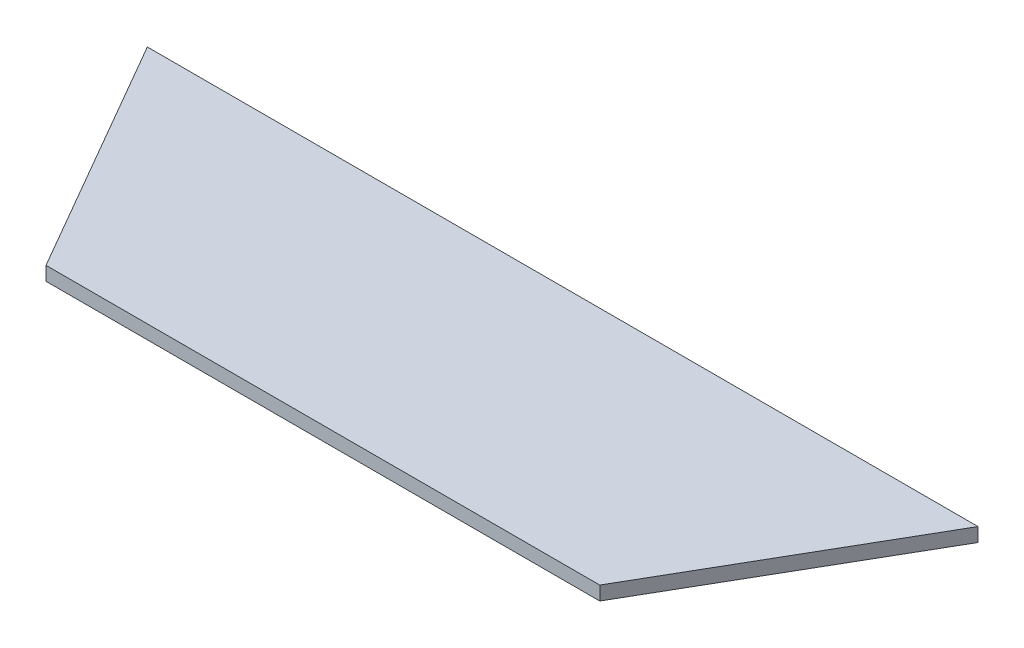
ISO-10303-21;
HEADER;
FILE_DESCRIPTION(('STEP AP214'),'2;1');
FILE_NAME('part.step','',(''),(''),'','','');
FILE_SCHEMA(('AUTOMOTIVE_DESIGN { 1 0 10303 214 1 1 1 1 }'));
ENDSEC;
DATA;
#1=APPLICATION_CONTEXT('core data for automotive mechanical design processes');
#2=APPLICATION_PROTOCOL_DEFINITION('international standard','automotive_design',2000,#1);
#3=PRODUCT_CONTEXT('',#1,'mechanical');
#4=PRODUCT('Part','Part','',(#3));
#5=PRODUCT_RELATED_PRODUCT_CATEGORY('part','',(#4));
#6=PRODUCT_DEFINITION_FORMATION('','',#4);
#7=PRODUCT_DEFINITION_CONTEXT('part definition',#1,'design');
#8=PRODUCT_DEFINITION('design','',#6,#7);
#9=PRODUCT_DEFINITION_SHAPE('','',#8);
#10=(LENGTH_UNIT() NAMED_UNIT(*) SI_UNIT(.MILLI.,.METRE.));
#11=(NAMED_UNIT(*) PLANE_ANGLE_UNIT() SI_UNIT($,.RADIAN.));
#12=(NAMED_UNIT(*) SI_UNIT($,.STERADIAN.) SOLID_ANGLE_UNIT());
#13=UNCERTAINTY_MEASURE_WITH_UNIT(LENGTH_MEASURE(1.E-05),#10,'distance_accuracy_value','');
#14=(GEOMETRIC_REPRESENTATION_CONTEXT(3) GLOBAL_UNCERTAINTY_ASSIGNED_CONTEXT((#13)) GLOBAL_UNIT_ASSIGNED_CONTEXT((#10,
#11,#12)) REPRESENTATION_CONTEXT('',''));
#15=CARTESIAN_POINT('',(0.,0.,0.));
#16=DIRECTION('',(0.,0.,1.));
#17=DIRECTION('',(1.,0.,0.));
#18=AXIS2_PLACEMENT_3D('',#15,#16,#17);
#19=CARTESIAN_POINT('',(-150.,5.,86.6025403784441));
#20=DIRECTION('',(0.,0.,1.));
#21=DIRECTION('',(1.,0.,0.));
#22=AXIS2_PLACEMENT_3D('',#19,#20,#21);
#23=PLANE('',#22);
#24=DIRECTION('',(-1.,0.,0.));
#25=VECTOR('',#24,1.);
#26=CARTESIAN_POINT('',(-150.,0.,86.6025403784441));
#27=LINE('',#26,#25);
#28=CARTESIAN_POINT('',(150.,0.,86.6025403784441));
#29=VERTEX_POINT('',#28);
#30=CARTESIAN_POINT('',(-150.,0.,86.6025403784441));
#31=VERTEX_POINT('',#30);
#32=EDGE_CURVE('E100',#29,#31,#27,.T.);
#33=ORIENTED_EDGE('',*,*,#32,.T.);
#34=DIRECTION('',(0.,-1.,0.));
#35=VECTOR('',#34,1.);
#36=CARTESIAN_POINT('',(-150.,5.,86.6025403784441));
#37=LINE('',#36,#35);
#38=CARTESIAN_POINT('',(-150.,5.,86.6025403784441));
#39=VERTEX_POINT('',#38);
#40=EDGE_CURVE('E11',#39,#31,#37,.T.);
#41=ORIENTED_EDGE('',*,*,#40,.F.);
#42=DIRECTION('',(-1.,0.,0.));
#43=VECTOR('',#42,1.);
#44=CARTESIAN_POINT('',(-150.,5.,86.6025403784441));
#45=LINE('',#44,#43);
#46=CARTESIAN_POINT('',(150.,5.,86.6025403784441));
#47=VERTEX_POINT('',#46);
#48=EDGE_CURVE('E88',#47,#39,#45,.T.);
#49=ORIENTED_EDGE('',*,*,#48,.F.);
#50=DIRECTION('',(0.,-1.,0.));
#51=VECTOR('',#50,1.);
#52=CARTESIAN_POINT('',(150.,5.,86.6025403784441));
#53=LINE('',#52,#51);
#54=EDGE_CURVE('E96',#47,#29,#53,.T.);
#55=ORIENTED_EDGE('',*,*,#54,.T.);
#56=EDGE_LOOP('',(#33,#41,#49,#55));
#57=FACE_BOUND('',#56,.T.);
#58=ADVANCED_FACE('F37',(#57),#23,.F.);
#59=CARTESIAN_POINT('',(-150.,5.,86.6025403784441));
#60=DIRECTION('',(0.86602540378443,0.,-0.500000000000014));
#61=DIRECTION('',(-0.500000000000014,0.,-0.86602540378443));
#62=AXIS2_PLACEMENT_3D('',#59,#60,#61);
#63=PLANE('',#62);
#64=DIRECTION('',(0.500000000000014,0.,0.86602540378443));
#65=VECTOR('',#64,1.);
#66=CARTESIAN_POINT('',(-150.,0.,86.6025403784441));
#67=LINE('',#66,#65);
#68=CARTESIAN_POINT('',(-99.9999999999982,0.,173.205080756888));
#69=VERTEX_POINT('',#68);
#70=EDGE_CURVE('E92',#31,#69,#67,.T.);
#71=ORIENTED_EDGE('',*,*,#70,.T.);
#72=DIRECTION('',(0.,-1.,0.));
#73=VECTOR('',#72,1.);
#74=CARTESIAN_POINT('',(-99.9999999999982,5.,173.205080756888));
#75=LINE('',#74,#73);
#76=CARTESIAN_POINT('',(-99.9999999999982,5.,173.205080756888));
#77=VERTEX_POINT('',#76);
#78=EDGE_CURVE('E45',#77,#69,#75,.T.);
#79=ORIENTED_EDGE('',*,*,#78,.F.);
#80=DIRECTION('',(0.500000000000014,0.,0.86602540378443));
#81=VECTOR('',#80,1.);
#82=CARTESIAN_POINT('',(-150.,5.,86.6025403784441));
#83=LINE('',#82,#81);
#84=EDGE_CURVE('E83',#39,#77,#83,.T.);
#85=ORIENTED_EDGE('',*,*,#84,.F.);
#86=ORIENTED_EDGE('',*,*,#40,.T.);
#87=EDGE_LOOP('',(#71,#79,#85,#86));
#88=FACE_BOUND('',#87,.T.);
#89=ADVANCED_FACE('F91',(#88),#63,.F.);
#90=CARTESIAN_POINT('',(-99.9999999999982,5.,173.205080756888));
#91=DIRECTION('',(0.,0.,-1.));
#92=DIRECTION('',(-1.,0.,0.));
#93=AXIS2_PLACEMENT_3D('',#90,#91,#92);
#94=PLANE('',#93);
#95=DIRECTION('',(1.,0.,0.));
#96=VECTOR('',#95,1.);
#97=CARTESIAN_POINT('',(-99.9999999999982,0.,173.205080756888));
#98=LINE('',#97,#96);
#99=CARTESIAN_POINT('',(100.000000000002,0.,173.205080756886));
#100=VERTEX_POINT('',#99);
#101=EDGE_CURVE('E70',#69,#100,#98,.T.);
#102=ORIENTED_EDGE('',*,*,#101,.T.);
#103=DIRECTION('',(0.,-1.,0.));
#104=VECTOR('',#103,1.);
#105=CARTESIAN_POINT('',(100.000000000002,5.,173.205080756886));
#106=LINE('',#105,#104);
#107=CARTESIAN_POINT('',(100.000000000002,5.,173.205080756886));
#108=VERTEX_POINT('',#107);
#109=EDGE_CURVE('E93',#108,#100,#106,.T.);
#110=ORIENTED_EDGE('',*,*,#109,.F.);
#111=DIRECTION('',(1.,0.,0.));
#112=VECTOR('',#111,1.);
#113=CARTESIAN_POINT('',(-99.9999999999982,5.,173.205080756888));
#114=LINE('',#113,#112);
#115=EDGE_CURVE('E86',#77,#108,#114,.T.);
#116=ORIENTED_EDGE('',*,*,#115,.F.);
#117=ORIENTED_EDGE('',*,*,#78,.T.);
#118=EDGE_LOOP('',(#102,#110,#116,#117));
#119=FACE_BOUND('',#118,.T.);
#120=ADVANCED_FACE('F94',(#119),#94,.F.);
#121=CARTESIAN_POINT('',(100.000000000002,5.,173.205080756886));
#122=DIRECTION('',(-0.866025403784441,0.,-0.499999999999996));
#123=DIRECTION('',(-0.499999999999996,0.,0.866025403784441));
#124=AXIS2_PLACEMENT_3D('',#121,#122,#123);
#125=PLANE('',#124);
#126=DIRECTION('',(0.499999999999996,0.,-0.866025403784441));
#127=VECTOR('',#126,1.);
#128=CARTESIAN_POINT('',(100.000000000002,0.,173.205080756886));
#129=LINE('',#128,#127);
#130=EDGE_CURVE('E76',#100,#29,#129,.T.);
#131=ORIENTED_EDGE('',*,*,#130,.T.);
#132=ORIENTED_EDGE('',*,*,#54,.F.);
#133=DIRECTION('',(0.499999999999996,0.,-0.866025403784441));
#134=VECTOR('',#133,1.);
#135=CARTESIAN_POINT('',(100.000000000002,5.,173.205080756886));
#136=LINE('',#135,#134);
#137=EDGE_CURVE('E53',#108,#47,#136,.T.);
#138=ORIENTED_EDGE('',*,*,#137,.F.);
#139=ORIENTED_EDGE('',*,*,#109,.T.);
#140=EDGE_LOOP('',(#131,#132,#138,#139));
#141=FACE_BOUND('',#140,.T.);
#142=ADVANCED_FACE('F107',(#141),#125,.F.);
#143=CARTESIAN_POINT('',(0.,5.,0.));
#144=DIRECTION('',(0.,1.,0.));
#145=DIRECTION('',(0.,0.,1.));
#146=AXIS2_PLACEMENT_3D('',#143,#144,#145);
#147=PLANE('',#146);
#148=ORIENTED_EDGE('',*,*,#48,.T.);
#149=ORIENTED_EDGE('',*,*,#84,.T.);
#150=ORIENTED_EDGE('',*,*,#115,.T.);
#151=ORIENTED_EDGE('',*,*,#137,.T.);
#152=EDGE_LOOP('',(#148,#149,#150,#151));
#153=FACE_BOUND('',#152,.T.);
#154=ADVANCED_FACE('F84',(#153),#147,.T.);
#155=CARTESIAN_POINT('',(0.,0.,0.));
#156=DIRECTION('',(0.,1.,0.));
#157=DIRECTION('',(0.,0.,1.));
#158=AXIS2_PLACEMENT_3D('',#155,#156,#157);
#159=PLANE('',#158);
#160=ORIENTED_EDGE('',*,*,#32,.F.);
#161=ORIENTED_EDGE('',*,*,#130,.F.);
#162=ORIENTED_EDGE('',*,*,#101,.F.);
#163=ORIENTED_EDGE('',*,*,#70,.F.);
#164=EDGE_LOOP('',(#160,#161,#162,#163));
#165=FACE_BOUND('',#164,.T.);
#166=ADVANCED_FACE('F110',(#165),#159,.F.);
#167=CLOSED_SHELL('',(#58,#89,#120,#142,#154,#166));
#168=MANIFOLD_SOLID_BREP('B2',#167);
#169=ADVANCED_BREP_SHAPE_REPRESENTATION('',(#18,#168),#14);
#170=SHAPE_DEFINITION_REPRESENTATION(#9,#169);
ENDSEC;
END-ISO-10303-21;
